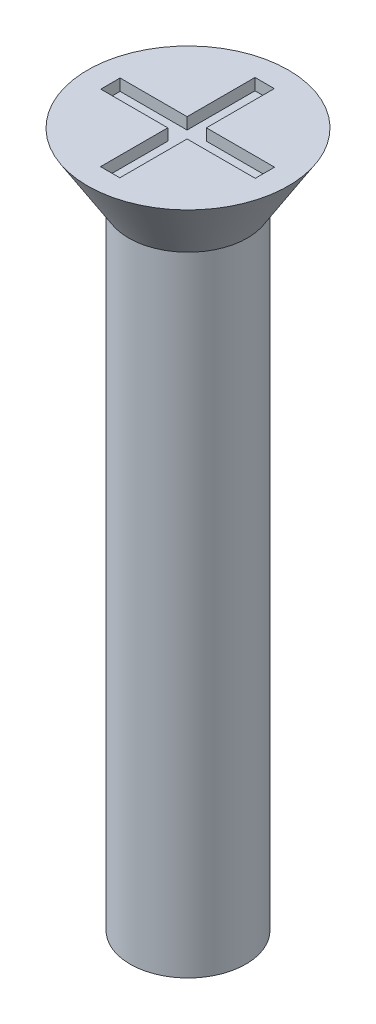
ISO-10303-21;
HEADER;
FILE_DESCRIPTION(('STEP AP214'),'2;1');
FILE_NAME('part.step','',(''),(''),'','','');
FILE_SCHEMA(('AUTOMOTIVE_DESIGN { 1 0 10303 214 1 1 1 1 }'));
ENDSEC;
DATA;
#1=APPLICATION_CONTEXT('core data for automotive mechanical design processes');
#2=APPLICATION_PROTOCOL_DEFINITION('international standard','automotive_design',2000,#1);
#3=PRODUCT_CONTEXT('',#1,'mechanical');
#4=PRODUCT('Part','Part','',(#3));
#5=PRODUCT_RELATED_PRODUCT_CATEGORY('part','',(#4));
#6=PRODUCT_DEFINITION_FORMATION('','',#4);
#7=PRODUCT_DEFINITION_CONTEXT('part definition',#1,'design');
#8=PRODUCT_DEFINITION('design','',#6,#7);
#9=PRODUCT_DEFINITION_SHAPE('','',#8);
#10=(LENGTH_UNIT() NAMED_UNIT(*) SI_UNIT(.MILLI.,.METRE.));
#11=(NAMED_UNIT(*) PLANE_ANGLE_UNIT() SI_UNIT($,.RADIAN.));
#12=(NAMED_UNIT(*) SI_UNIT($,.STERADIAN.) SOLID_ANGLE_UNIT());
#13=UNCERTAINTY_MEASURE_WITH_UNIT(LENGTH_MEASURE(1.E-05),#10,'distance_accuracy_value','');
#14=(GEOMETRIC_REPRESENTATION_CONTEXT(3) GLOBAL_UNCERTAINTY_ASSIGNED_CONTEXT((#13)) GLOBAL_UNIT_ASSIGNED_CONTEXT((#10,
#11,#12)) REPRESENTATION_CONTEXT('',''));
#15=CARTESIAN_POINT('',(0.,0.,0.));
#16=DIRECTION('',(0.,0.,1.));
#17=DIRECTION('',(1.,0.,0.));
#18=AXIS2_PLACEMENT_3D('',#15,#16,#17);
#19=CARTESIAN_POINT('',(0.,18.,0.));
#20=DIRECTION('',(0.,1.,0.));
#21=DIRECTION('',(0.,0.,1.));
#22=AXIS2_PLACEMENT_3D('',#19,#20,#21);
#23=PLANE('',#22);
#24=CARTESIAN_POINT('',(0.,18.,0.));
#25=DIRECTION('',(0.,1.,0.));
#26=DIRECTION('',(0.,0.,1.));
#27=AXIS2_PLACEMENT_3D('',#24,#25,#26);
#28=CIRCLE('',#27,2.6);
#29=CARTESIAN_POINT('',(0.,18.,2.6));
#30=VERTEX_POINT('',#29);
#31=EDGE_CURVE('E192',#30,#30,#28,.T.);
#32=ORIENTED_EDGE('',*,*,#31,.T.);
#33=EDGE_LOOP('',(#32));
#34=FACE_BOUND('',#33,.T.);
#35=DIRECTION('',(1.,0.,0.));
#36=VECTOR('',#35,1.);
#37=CARTESIAN_POINT('',(0.,18.,-2.));
#38=LINE('',#37,#36);
#39=CARTESIAN_POINT('',(-0.265272843023468,18.,-2.));
#40=VERTEX_POINT('',#39);
#41=CARTESIAN_POINT('',(0.234727156976532,18.,-2.));
#42=VERTEX_POINT('',#41);
#43=EDGE_CURVE('E161',#40,#42,#38,.T.);
#44=ORIENTED_EDGE('',*,*,#43,.T.);
#45=DIRECTION('',(0.,0.,1.));
#46=VECTOR('',#45,1.);
#47=CARTESIAN_POINT('',(0.234727156976532,18.,0.));
#48=LINE('',#47,#46);
#49=CARTESIAN_POINT('',(0.234727156976532,18.,-0.241621514992573));
#50=VERTEX_POINT('',#49);
#51=EDGE_CURVE('E48',#42,#50,#48,.T.);
#52=ORIENTED_EDGE('',*,*,#51,.T.);
#53=DIRECTION('',(1.,0.,0.));
#54=VECTOR('',#53,1.);
#55=CARTESIAN_POINT('',(0.,18.,-0.241621514992573));
#56=LINE('',#55,#54);
#57=CARTESIAN_POINT('',(2.,18.,-0.241621514992573));
#58=VERTEX_POINT('',#57);
#59=EDGE_CURVE('E98',#50,#58,#56,.T.);
#60=ORIENTED_EDGE('',*,*,#59,.T.);
#61=DIRECTION('',(0.,0.,1.));
#62=VECTOR('',#61,1.);
#63=CARTESIAN_POINT('',(2.,18.,0.));
#64=LINE('',#63,#62);
#65=CARTESIAN_POINT('',(2.,18.,0.258378485007427));
#66=VERTEX_POINT('',#65);
#67=EDGE_CURVE('E186',#58,#66,#64,.T.);
#68=ORIENTED_EDGE('',*,*,#67,.T.);
#69=DIRECTION('',(1.,0.,0.));
#70=VECTOR('',#69,1.);
#71=CARTESIAN_POINT('',(0.,18.,0.258378485007427));
#72=LINE('',#71,#70);
#73=CARTESIAN_POINT('',(0.234727156976532,18.,0.258378485007427));
#74=VERTEX_POINT('',#73);
#75=EDGE_CURVE('E145',#74,#66,#72,.T.);
#76=ORIENTED_EDGE('',*,*,#75,.F.);
#77=DIRECTION('',(0.,0.,1.));
#78=VECTOR('',#77,1.);
#79=CARTESIAN_POINT('',(0.234727156976532,18.,0.));
#80=LINE('',#79,#78);
#81=CARTESIAN_POINT('',(0.234727156976533,18.,2.));
#82=VERTEX_POINT('',#81);
#83=EDGE_CURVE('E182',#74,#82,#80,.T.);
#84=ORIENTED_EDGE('',*,*,#83,.T.);
#85=DIRECTION('',(1.,0.,0.));
#86=VECTOR('',#85,1.);
#87=CARTESIAN_POINT('',(0.,18.,2.));
#88=LINE('',#87,#86);
#89=CARTESIAN_POINT('',(-0.265272843023467,18.,2.));
#90=VERTEX_POINT('',#89);
#91=EDGE_CURVE('E179',#90,#82,#88,.T.);
#92=ORIENTED_EDGE('',*,*,#91,.F.);
#93=DIRECTION('',(0.,0.,1.));
#94=VECTOR('',#93,1.);
#95=CARTESIAN_POINT('',(-0.265272843023468,18.,0.));
#96=LINE('',#95,#94);
#97=CARTESIAN_POINT('',(-0.265272843023468,18.,0.258378485007427));
#98=VERTEX_POINT('',#97);
#99=EDGE_CURVE('E176',#98,#90,#96,.T.);
#100=ORIENTED_EDGE('',*,*,#99,.F.);
#101=DIRECTION('',(1.,0.,0.));
#102=VECTOR('',#101,1.);
#103=CARTESIAN_POINT('',(0.,18.,0.258378485007427));
#104=LINE('',#103,#102);
#105=CARTESIAN_POINT('',(-2.,18.,0.258378485007427));
#106=VERTEX_POINT('',#105);
#107=EDGE_CURVE('E173',#106,#98,#104,.T.);
#108=ORIENTED_EDGE('',*,*,#107,.F.);
#109=DIRECTION('',(0.,0.,1.));
#110=VECTOR('',#109,1.);
#111=CARTESIAN_POINT('',(-2.,18.,0.));
#112=LINE('',#111,#110);
#113=CARTESIAN_POINT('',(-2.,18.,-0.241621514992573));
#114=VERTEX_POINT('',#113);
#115=EDGE_CURVE('E170',#114,#106,#112,.T.);
#116=ORIENTED_EDGE('',*,*,#115,.F.);
#117=DIRECTION('',(1.,0.,0.));
#118=VECTOR('',#117,1.);
#119=CARTESIAN_POINT('',(0.,18.,-0.241621514992573));
#120=LINE('',#119,#118);
#121=CARTESIAN_POINT('',(-0.265272843023468,18.,-0.241621514992573));
#122=VERTEX_POINT('',#121);
#123=EDGE_CURVE('E167',#114,#122,#120,.T.);
#124=ORIENTED_EDGE('',*,*,#123,.T.);
#125=DIRECTION('',(0.,0.,1.));
#126=VECTOR('',#125,1.);
#127=CARTESIAN_POINT('',(-0.265272843023468,18.,0.));
#128=LINE('',#127,#126);
#129=EDGE_CURVE('E164',#40,#122,#128,.T.);
#130=ORIENTED_EDGE('',*,*,#129,.F.);
#131=EDGE_LOOP('',(#44,#52,#60,#68,#76,#84,#92,#100,#108,#116,#124,#130));
#132=FACE_BOUND('',#131,.T.);
#133=ADVANCED_FACE('F33',(#34,#132),#23,.T.);
#134=CARTESIAN_POINT('',(0.,18.,0.));
#135=DIRECTION('',(0.,-1.,0.));
#136=DIRECTION('',(0.,0.,-1.));
#137=AXIS2_PLACEMENT_3D('',#134,#135,#136);
#138=CYLINDRICAL_SURFACE('',#137,1.5);
#139=CARTESIAN_POINT('',(0.,0.,0.));
#140=DIRECTION('',(0.,1.,0.));
#141=DIRECTION('',(0.,0.,1.));
#142=AXIS2_PLACEMENT_3D('',#139,#140,#141);
#143=CIRCLE('',#142,1.5);
#144=CARTESIAN_POINT('',(0.,0.,1.5));
#145=VERTEX_POINT('',#144);
#146=EDGE_CURVE('E41',#145,#145,#143,.T.);
#147=ORIENTED_EDGE('',*,*,#146,.T.);
#148=EDGE_LOOP('',(#147));
#149=FACE_BOUND('',#148,.T.);
#150=CARTESIAN_POINT('',(0.,16.3,0.));
#151=DIRECTION('',(0.,1.,0.));
#152=DIRECTION('',(0.,0.,1.));
#153=AXIS2_PLACEMENT_3D('',#150,#151,#152);
#154=CIRCLE('',#153,1.5);
#155=CARTESIAN_POINT('',(0.,16.3,1.5));
#156=VERTEX_POINT('',#155);
#157=EDGE_CURVE('E11',#156,#156,#154,.T.);
#158=ORIENTED_EDGE('',*,*,#157,.F.);
#159=EDGE_LOOP('',(#158));
#160=FACE_BOUND('',#159,.T.);
#161=ADVANCED_FACE('F35',(#149,#160),#138,.T.);
#162=CARTESIAN_POINT('',(0.,0.,0.));
#163=DIRECTION('',(0.,1.,0.));
#164=DIRECTION('',(0.,0.,1.));
#165=AXIS2_PLACEMENT_3D('',#162,#163,#164);
#166=PLANE('',#165);
#167=ORIENTED_EDGE('',*,*,#146,.F.);
#168=EDGE_LOOP('',(#167));
#169=FACE_BOUND('',#168,.T.);
#170=ADVANCED_FACE('F219',(#169),#166,.F.);
#171=CARTESIAN_POINT('',(0.,18.,0.));
#172=DIRECTION('',(0.,1.,0.));
#173=DIRECTION('',(0.,0.,1.));
#174=AXIS2_PLACEMENT_3D('',#171,#172,#173);
#175=CONICAL_SURFACE('',#174,2.6,0.558505360638187);
#176=CARTESIAN_POINT('',(0.,16.3,0.));
#177=DIRECTION('',(0.,1.,0.));
#178=DIRECTION('',(0.,0.,1.));
#179=AXIS2_PLACEMENT_3D('',#176,#177,#178);
#180=CIRCLE('',#179,1.53772210175414);
#181=CARTESIAN_POINT('',(0.,16.3,1.53772210175414));
#182=VERTEX_POINT('',#181);
#183=EDGE_CURVE('E212',#182,#182,#180,.T.);
#184=ORIENTED_EDGE('',*,*,#183,.T.);
#185=EDGE_LOOP('',(#184));
#186=FACE_BOUND('',#185,.T.);
#187=ORIENTED_EDGE('',*,*,#31,.F.);
#188=EDGE_LOOP('',(#187));
#189=FACE_BOUND('',#188,.T.);
#190=ADVANCED_FACE('F221',(#186,#189),#175,.T.);
#191=CARTESIAN_POINT('',(0.,16.3,0.));
#192=DIRECTION('',(0.,1.,0.));
#193=DIRECTION('',(0.,0.,1.));
#194=AXIS2_PLACEMENT_3D('',#191,#192,#193);
#195=PLANE('',#194);
#196=ORIENTED_EDGE('',*,*,#157,.T.);
#197=EDGE_LOOP('',(#196));
#198=FACE_BOUND('',#197,.T.);
#199=ORIENTED_EDGE('',*,*,#183,.F.);
#200=EDGE_LOOP('',(#199));
#201=FACE_BOUND('',#200,.T.);
#202=ADVANCED_FACE('F226',(#198,#201),#195,.F.);
#203=CARTESIAN_POINT('',(0.234727156976532,17.7,0.));
#204=DIRECTION('',(-1.,0.,0.));
#205=DIRECTION('',(0.,0.,1.));
#206=AXIS2_PLACEMENT_3D('',#203,#204,#205);
#207=PLANE('',#206);
#208=ORIENTED_EDGE('',*,*,#51,.F.);
#209=DIRECTION('',(0.,1.,0.));
#210=VECTOR('',#209,1.);
#211=CARTESIAN_POINT('',(0.234727156976532,17.7,-2.));
#212=LINE('',#211,#210);
#213=CARTESIAN_POINT('',(0.234727156976532,17.7,-2.));
#214=VERTEX_POINT('',#213);
#215=EDGE_CURVE('E159',#214,#42,#212,.T.);
#216=ORIENTED_EDGE('',*,*,#215,.F.);
#217=DIRECTION('',(0.,0.,1.));
#218=VECTOR('',#217,1.);
#219=CARTESIAN_POINT('',(0.234727156976532,17.7,0.));
#220=LINE('',#219,#218);
#221=CARTESIAN_POINT('',(0.234727156976532,17.7,-0.241621514992573));
#222=VERTEX_POINT('',#221);
#223=EDGE_CURVE('E189',#214,#222,#220,.T.);
#224=ORIENTED_EDGE('',*,*,#223,.T.);
#225=DIRECTION('',(0.,1.,0.));
#226=VECTOR('',#225,1.);
#227=CARTESIAN_POINT('',(0.234727156976532,17.7,-0.241621514992573));
#228=LINE('',#227,#226);
#229=EDGE_CURVE('E190',#222,#50,#228,.T.);
#230=ORIENTED_EDGE('',*,*,#229,.T.);
#231=EDGE_LOOP('',(#208,#216,#224,#230));
#232=FACE_BOUND('',#231,.T.);
#233=ADVANCED_FACE('F238',(#232),#207,.T.);
#234=CARTESIAN_POINT('',(0.,17.7,-0.241621514992573));
#235=DIRECTION('',(0.,0.,1.));
#236=DIRECTION('',(1.,0.,0.));
#237=AXIS2_PLACEMENT_3D('',#234,#235,#236);
#238=PLANE('',#237);
#239=ORIENTED_EDGE('',*,*,#59,.F.);
#240=ORIENTED_EDGE('',*,*,#229,.F.);
#241=DIRECTION('',(1.,0.,0.));
#242=VECTOR('',#241,1.);
#243=CARTESIAN_POINT('',(0.,17.7,-0.241621514992573));
#244=LINE('',#243,#242);
#245=CARTESIAN_POINT('',(2.,17.7,-0.241621514992573));
#246=VERTEX_POINT('',#245);
#247=EDGE_CURVE('E57',#222,#246,#244,.T.);
#248=ORIENTED_EDGE('',*,*,#247,.T.);
#249=DIRECTION('',(0.,1.,0.));
#250=VECTOR('',#249,1.);
#251=CARTESIAN_POINT('',(2.,17.7,-0.241621514992573));
#252=LINE('',#251,#250);
#253=EDGE_CURVE('E137',#246,#58,#252,.T.);
#254=ORIENTED_EDGE('',*,*,#253,.T.);
#255=EDGE_LOOP('',(#239,#240,#248,#254));
#256=FACE_BOUND('',#255,.T.);
#257=ADVANCED_FACE('F242',(#256),#238,.T.);
#258=CARTESIAN_POINT('',(2.,17.7,0.));
#259=DIRECTION('',(-1.,0.,0.));
#260=DIRECTION('',(0.,0.,1.));
#261=AXIS2_PLACEMENT_3D('',#258,#259,#260);
#262=PLANE('',#261);
#263=ORIENTED_EDGE('',*,*,#67,.F.);
#264=ORIENTED_EDGE('',*,*,#253,.F.);
#265=DIRECTION('',(0.,0.,1.));
#266=VECTOR('',#265,1.);
#267=CARTESIAN_POINT('',(2.,17.7,0.));
#268=LINE('',#267,#266);
#269=CARTESIAN_POINT('',(2.,17.7,0.258378485007427));
#270=VERTEX_POINT('',#269);
#271=EDGE_CURVE('E131',#246,#270,#268,.T.);
#272=ORIENTED_EDGE('',*,*,#271,.T.);
#273=DIRECTION('',(0.,1.,0.));
#274=VECTOR('',#273,1.);
#275=CARTESIAN_POINT('',(2.,17.7,0.258378485007427));
#276=LINE('',#275,#274);
#277=EDGE_CURVE('E135',#270,#66,#276,.T.);
#278=ORIENTED_EDGE('',*,*,#277,.T.);
#279=EDGE_LOOP('',(#263,#264,#272,#278));
#280=FACE_BOUND('',#279,.T.);
#281=ADVANCED_FACE('F134',(#280),#262,.T.);
#282=CARTESIAN_POINT('',(0.,17.7,0.258378485007427));
#283=DIRECTION('',(0.,0.,1.));
#284=DIRECTION('',(1.,0.,0.));
#285=AXIS2_PLACEMENT_3D('',#282,#283,#284);
#286=PLANE('',#285);
#287=ORIENTED_EDGE('',*,*,#75,.T.);
#288=ORIENTED_EDGE('',*,*,#277,.F.);
#289=DIRECTION('',(1.,0.,0.));
#290=VECTOR('',#289,1.);
#291=CARTESIAN_POINT('',(0.,17.7,0.258378485007427));
#292=LINE('',#291,#290);
#293=CARTESIAN_POINT('',(0.234727156976532,17.7,0.258378485007427));
#294=VERTEX_POINT('',#293);
#295=EDGE_CURVE('E139',#294,#270,#292,.T.);
#296=ORIENTED_EDGE('',*,*,#295,.F.);
#297=DIRECTION('',(0.,1.,0.));
#298=VECTOR('',#297,1.);
#299=CARTESIAN_POINT('',(0.234727156976532,17.7,0.258378485007427));
#300=LINE('',#299,#298);
#301=EDGE_CURVE('E147',#294,#74,#300,.T.);
#302=ORIENTED_EDGE('',*,*,#301,.T.);
#303=EDGE_LOOP('',(#287,#288,#296,#302));
#304=FACE_BOUND('',#303,.T.);
#305=ADVANCED_FACE('F143',(#304),#286,.F.);
#306=CARTESIAN_POINT('',(0.234727156976532,17.7,0.));
#307=DIRECTION('',(-1.,0.,0.));
#308=DIRECTION('',(0.,0.,1.));
#309=AXIS2_PLACEMENT_3D('',#306,#307,#308);
#310=PLANE('',#309);
#311=ORIENTED_EDGE('',*,*,#83,.F.);
#312=ORIENTED_EDGE('',*,*,#301,.F.);
#313=DIRECTION('',(0.,0.,1.));
#314=VECTOR('',#313,1.);
#315=CARTESIAN_POINT('',(0.234727156976532,17.7,0.));
#316=LINE('',#315,#314);
#317=CARTESIAN_POINT('',(0.234727156976533,17.7,2.));
#318=VERTEX_POINT('',#317);
#319=EDGE_CURVE('E152',#294,#318,#316,.T.);
#320=ORIENTED_EDGE('',*,*,#319,.T.);
#321=DIRECTION('',(0.,1.,0.));
#322=VECTOR('',#321,1.);
#323=CARTESIAN_POINT('',(0.234727156976533,17.7,2.));
#324=LINE('',#323,#322);
#325=EDGE_CURVE('E195',#318,#82,#324,.T.);
#326=ORIENTED_EDGE('',*,*,#325,.T.);
#327=EDGE_LOOP('',(#311,#312,#320,#326));
#328=FACE_BOUND('',#327,.T.);
#329=ADVANCED_FACE('F269',(#328),#310,.T.);
#330=CARTESIAN_POINT('',(0.,17.7,2.));
#331=DIRECTION('',(0.,0.,1.));
#332=DIRECTION('',(1.,0.,0.));
#333=AXIS2_PLACEMENT_3D('',#330,#331,#332);
#334=PLANE('',#333);
#335=ORIENTED_EDGE('',*,*,#91,.T.);
#336=ORIENTED_EDGE('',*,*,#325,.F.);
#337=DIRECTION('',(1.,0.,0.));
#338=VECTOR('',#337,1.);
#339=CARTESIAN_POINT('',(0.,17.7,2.));
#340=LINE('',#339,#338);
#341=CARTESIAN_POINT('',(-0.265272843023467,17.7,2.));
#342=VERTEX_POINT('',#341);
#343=EDGE_CURVE('E154',#342,#318,#340,.T.);
#344=ORIENTED_EDGE('',*,*,#343,.F.);
#345=DIRECTION('',(0.,1.,0.));
#346=VECTOR('',#345,1.);
#347=CARTESIAN_POINT('',(-0.265272843023467,17.7,2.));
#348=LINE('',#347,#346);
#349=EDGE_CURVE('E197',#342,#90,#348,.T.);
#350=ORIENTED_EDGE('',*,*,#349,.T.);
#351=EDGE_LOOP('',(#335,#336,#344,#350));
#352=FACE_BOUND('',#351,.T.);
#353=ADVANCED_FACE('F265',(#352),#334,.F.);
#354=CARTESIAN_POINT('',(-0.265272843023468,17.7,0.));
#355=DIRECTION('',(-1.,0.,0.));
#356=DIRECTION('',(0.,0.,1.));
#357=AXIS2_PLACEMENT_3D('',#354,#355,#356);
#358=PLANE('',#357);
#359=ORIENTED_EDGE('',*,*,#99,.T.);
#360=ORIENTED_EDGE('',*,*,#349,.F.);
#361=DIRECTION('',(0.,0.,1.));
#362=VECTOR('',#361,1.);
#363=CARTESIAN_POINT('',(-0.265272843023468,17.7,0.));
#364=LINE('',#363,#362);
#365=CARTESIAN_POINT('',(-0.265272843023468,17.7,0.258378485007427));
#366=VERTEX_POINT('',#365);
#367=EDGE_CURVE('E417',#366,#342,#364,.T.);
#368=ORIENTED_EDGE('',*,*,#367,.F.);
#369=DIRECTION('',(0.,1.,0.));
#370=VECTOR('',#369,1.);
#371=CARTESIAN_POINT('',(-0.265272843023468,17.7,0.258378485007427));
#372=LINE('',#371,#370);
#373=EDGE_CURVE('E199',#366,#98,#372,.T.);
#374=ORIENTED_EDGE('',*,*,#373,.T.);
#375=EDGE_LOOP('',(#359,#360,#368,#374));
#376=FACE_BOUND('',#375,.T.);
#377=ADVANCED_FACE('F261',(#376),#358,.F.);
#378=CARTESIAN_POINT('',(0.,17.7,0.258378485007427));
#379=DIRECTION('',(0.,0.,1.));
#380=DIRECTION('',(1.,0.,0.));
#381=AXIS2_PLACEMENT_3D('',#378,#379,#380);
#382=PLANE('',#381);
#383=ORIENTED_EDGE('',*,*,#107,.T.);
#384=ORIENTED_EDGE('',*,*,#373,.F.);
#385=DIRECTION('',(1.,0.,0.));
#386=VECTOR('',#385,1.);
#387=CARTESIAN_POINT('',(0.,17.7,0.258378485007427));
#388=LINE('',#387,#386);
#389=CARTESIAN_POINT('',(-2.,17.7,0.258378485007427));
#390=VERTEX_POINT('',#389);
#391=EDGE_CURVE('E414',#390,#366,#388,.T.);
#392=ORIENTED_EDGE('',*,*,#391,.F.);
#393=DIRECTION('',(0.,1.,0.));
#394=VECTOR('',#393,1.);
#395=CARTESIAN_POINT('',(-2.,17.7,0.258378485007427));
#396=LINE('',#395,#394);
#397=EDGE_CURVE('E201',#390,#106,#396,.T.);
#398=ORIENTED_EDGE('',*,*,#397,.T.);
#399=EDGE_LOOP('',(#383,#384,#392,#398));
#400=FACE_BOUND('',#399,.T.);
#401=ADVANCED_FACE('F257',(#400),#382,.F.);
#402=CARTESIAN_POINT('',(-2.,17.7,0.));
#403=DIRECTION('',(-1.,0.,0.));
#404=DIRECTION('',(0.,0.,1.));
#405=AXIS2_PLACEMENT_3D('',#402,#403,#404);
#406=PLANE('',#405);
#407=ORIENTED_EDGE('',*,*,#115,.T.);
#408=ORIENTED_EDGE('',*,*,#397,.F.);
#409=DIRECTION('',(0.,0.,1.));
#410=VECTOR('',#409,1.);
#411=CARTESIAN_POINT('',(-2.,17.7,0.));
#412=LINE('',#411,#410);
#413=CARTESIAN_POINT('',(-2.,17.7,-0.241621514992573));
#414=VERTEX_POINT('',#413);
#415=EDGE_CURVE('E411',#414,#390,#412,.T.);
#416=ORIENTED_EDGE('',*,*,#415,.F.);
#417=DIRECTION('',(0.,1.,0.));
#418=VECTOR('',#417,1.);
#419=CARTESIAN_POINT('',(-2.,17.7,-0.241621514992573));
#420=LINE('',#419,#418);
#421=EDGE_CURVE('E203',#414,#114,#420,.T.);
#422=ORIENTED_EDGE('',*,*,#421,.T.);
#423=EDGE_LOOP('',(#407,#408,#416,#422));
#424=FACE_BOUND('',#423,.T.);
#425=ADVANCED_FACE('F253',(#424),#406,.F.);
#426=CARTESIAN_POINT('',(0.,17.7,-0.241621514992573));
#427=DIRECTION('',(0.,0.,1.));
#428=DIRECTION('',(1.,0.,0.));
#429=AXIS2_PLACEMENT_3D('',#426,#427,#428);
#430=PLANE('',#429);
#431=ORIENTED_EDGE('',*,*,#123,.F.);
#432=ORIENTED_EDGE('',*,*,#421,.F.);
#433=DIRECTION('',(1.,0.,0.));
#434=VECTOR('',#433,1.);
#435=CARTESIAN_POINT('',(0.,17.7,-0.241621514992573));
#436=LINE('',#435,#434);
#437=CARTESIAN_POINT('',(-0.265272843023468,17.7,-0.241621514992573));
#438=VERTEX_POINT('',#437);
#439=EDGE_CURVE('E409',#414,#438,#436,.T.);
#440=ORIENTED_EDGE('',*,*,#439,.T.);
#441=DIRECTION('',(0.,1.,0.));
#442=VECTOR('',#441,1.);
#443=CARTESIAN_POINT('',(-0.265272843023468,17.7,-0.241621514992573));
#444=LINE('',#443,#442);
#445=EDGE_CURVE('E205',#438,#122,#444,.T.);
#446=ORIENTED_EDGE('',*,*,#445,.T.);
#447=EDGE_LOOP('',(#431,#432,#440,#446));
#448=FACE_BOUND('',#447,.T.);
#449=ADVANCED_FACE('F249',(#448),#430,.T.);
#450=CARTESIAN_POINT('',(-0.265272843023468,17.7,0.));
#451=DIRECTION('',(-1.,0.,0.));
#452=DIRECTION('',(0.,0.,1.));
#453=AXIS2_PLACEMENT_3D('',#450,#451,#452);
#454=PLANE('',#453);
#455=ORIENTED_EDGE('',*,*,#129,.T.);
#456=ORIENTED_EDGE('',*,*,#445,.F.);
#457=DIRECTION('',(0.,0.,1.));
#458=VECTOR('',#457,1.);
#459=CARTESIAN_POINT('',(-0.265272843023468,17.7,0.));
#460=LINE('',#459,#458);
#461=CARTESIAN_POINT('',(-0.265272843023468,17.7,-2.));
#462=VERTEX_POINT('',#461);
#463=EDGE_CURVE('E405',#462,#438,#460,.T.);
#464=ORIENTED_EDGE('',*,*,#463,.F.);
#465=DIRECTION('',(0.,1.,0.));
#466=VECTOR('',#465,1.);
#467=CARTESIAN_POINT('',(-0.265272843023468,17.7,-2.));
#468=LINE('',#467,#466);
#469=EDGE_CURVE('E207',#462,#40,#468,.T.);
#470=ORIENTED_EDGE('',*,*,#469,.T.);
#471=EDGE_LOOP('',(#455,#456,#464,#470));
#472=FACE_BOUND('',#471,.T.);
#473=ADVANCED_FACE('F246',(#472),#454,.F.);
#474=CARTESIAN_POINT('',(0.,17.7,-2.));
#475=DIRECTION('',(0.,0.,1.));
#476=DIRECTION('',(1.,0.,0.));
#477=AXIS2_PLACEMENT_3D('',#474,#475,#476);
#478=PLANE('',#477);
#479=ORIENTED_EDGE('',*,*,#43,.F.);
#480=ORIENTED_EDGE('',*,*,#469,.F.);
#481=DIRECTION('',(1.,0.,0.));
#482=VECTOR('',#481,1.);
#483=CARTESIAN_POINT('',(0.,17.7,-2.));
#484=LINE('',#483,#482);
#485=EDGE_CURVE('E105',#462,#214,#484,.T.);
#486=ORIENTED_EDGE('',*,*,#485,.T.);
#487=ORIENTED_EDGE('',*,*,#215,.T.);
#488=EDGE_LOOP('',(#479,#480,#486,#487));
#489=FACE_BOUND('',#488,.T.);
#490=ADVANCED_FACE('F243',(#489),#478,.T.);
#491=CARTESIAN_POINT('',(0.,17.7,0.));
#492=DIRECTION('',(0.,1.,0.));
#493=DIRECTION('',(0.,0.,1.));
#494=AXIS2_PLACEMENT_3D('',#491,#492,#493);
#495=PLANE('',#494);
#496=ORIENTED_EDGE('',*,*,#223,.F.);
#497=ORIENTED_EDGE('',*,*,#485,.F.);
#498=ORIENTED_EDGE('',*,*,#463,.T.);
#499=ORIENTED_EDGE('',*,*,#439,.F.);
#500=ORIENTED_EDGE('',*,*,#415,.T.);
#501=ORIENTED_EDGE('',*,*,#391,.T.);
#502=ORIENTED_EDGE('',*,*,#367,.T.);
#503=ORIENTED_EDGE('',*,*,#343,.T.);
#504=ORIENTED_EDGE('',*,*,#319,.F.);
#505=ORIENTED_EDGE('',*,*,#295,.T.);
#506=ORIENTED_EDGE('',*,*,#271,.F.);
#507=ORIENTED_EDGE('',*,*,#247,.F.);
#508=EDGE_LOOP('',(#496,#497,#498,#499,#500,#501,#502,#503,#504,#505,#506,#507));
#509=FACE_BOUND('',#508,.T.);
#510=ADVANCED_FACE('F150',(#509),#495,.T.);
#511=CLOSED_SHELL('',(#133,#161,#170,#190,#202,#233,#257,#281,#305,#329,#353,#377,#401,#425,
#449,#473,#490,#510));
#512=MANIFOLD_SOLID_BREP('B2',#511);
#513=ADVANCED_BREP_SHAPE_REPRESENTATION('',(#18,#512),#14);
#514=SHAPE_DEFINITION_REPRESENTATION(#9,#513);
ENDSEC;
END-ISO-10303-21;
